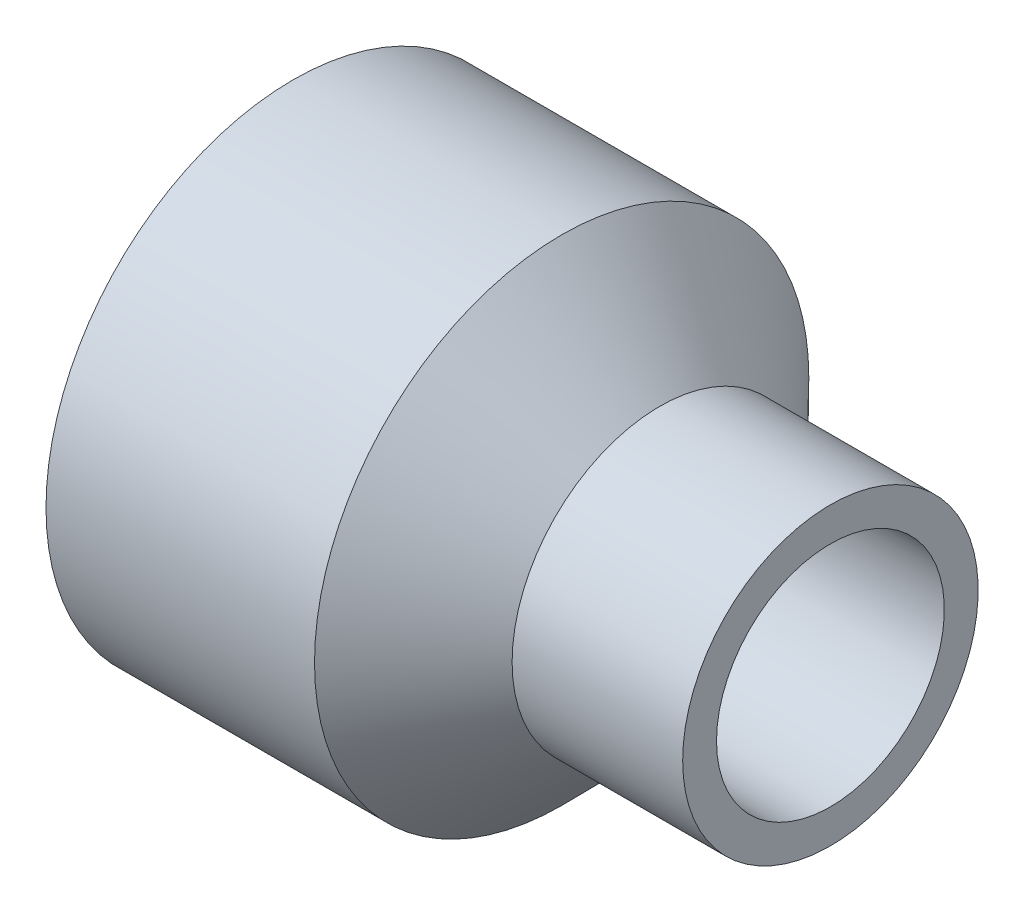
ISO-10303-21;
HEADER;
FILE_DESCRIPTION(('STEP AP214'),'2;1');
FILE_NAME('part.step','',(''),(''),'','','');
FILE_SCHEMA(('AUTOMOTIVE_DESIGN { 1 0 10303 214 1 1 1 1 }'));
ENDSEC;
DATA;
#1=APPLICATION_CONTEXT('core data for automotive mechanical design processes');
#2=APPLICATION_PROTOCOL_DEFINITION('international standard','automotive_design',2000,#1);
#3=PRODUCT_CONTEXT('',#1,'mechanical');
#4=PRODUCT('Part','Part','',(#3));
#5=PRODUCT_RELATED_PRODUCT_CATEGORY('part','',(#4));
#6=PRODUCT_DEFINITION_FORMATION('','',#4);
#7=PRODUCT_DEFINITION_CONTEXT('part definition',#1,'design');
#8=PRODUCT_DEFINITION('design','',#6,#7);
#9=PRODUCT_DEFINITION_SHAPE('','',#8);
#10=(LENGTH_UNIT() NAMED_UNIT(*) SI_UNIT(.MILLI.,.METRE.));
#11=(NAMED_UNIT(*) PLANE_ANGLE_UNIT() SI_UNIT($,.RADIAN.));
#12=(NAMED_UNIT(*) SI_UNIT($,.STERADIAN.) SOLID_ANGLE_UNIT());
#13=UNCERTAINTY_MEASURE_WITH_UNIT(LENGTH_MEASURE(1.E-05),#10,'distance_accuracy_value','');
#14=(GEOMETRIC_REPRESENTATION_CONTEXT(3) GLOBAL_UNCERTAINTY_ASSIGNED_CONTEXT((#13)) GLOBAL_UNIT_ASSIGNED_CONTEXT((#10,
#11,#12)) REPRESENTATION_CONTEXT('',''));
#15=CARTESIAN_POINT('',(0.,0.,0.));
#16=DIRECTION('',(0.,0.,1.));
#17=DIRECTION('',(1.,0.,0.));
#18=AXIS2_PLACEMENT_3D('',#15,#16,#17);
#19=CARTESIAN_POINT('',(-39.6875,0.,0.));
#20=DIRECTION('',(-1.,0.,0.));
#21=DIRECTION('',(0.,0.,1.));
#22=AXIS2_PLACEMENT_3D('',#19,#20,#21);
#23=CYLINDRICAL_SURFACE('',#22,36.5125);
#24=CARTESIAN_POINT('',(-0.0176611791230172,0.,0.));
#25=DIRECTION('',(-1.,0.,0.));
#26=DIRECTION('',(0.,0.,1.));
#27=AXIS2_PLACEMENT_3D('',#24,#25,#26);
#28=CIRCLE('',#27,36.5125);
#29=CARTESIAN_POINT('',(-0.0176611791230172,0.,36.5125));
#30=VERTEX_POINT('',#29);
#31=EDGE_CURVE('E63',#30,#30,#28,.T.);
#32=ORIENTED_EDGE('',*,*,#31,.T.);
#33=EDGE_LOOP('',(#32));
#34=FACE_BOUND('',#33,.T.);
#35=CARTESIAN_POINT('',(-39.6875,0.,0.));
#36=DIRECTION('',(-1.,0.,0.));
#37=DIRECTION('',(0.,0.,1.));
#38=AXIS2_PLACEMENT_3D('',#35,#36,#37);
#39=CIRCLE('',#38,36.5125);
#40=CARTESIAN_POINT('',(-39.6875,0.,36.5125));
#41=VERTEX_POINT('',#40);
#42=EDGE_CURVE('E10',#41,#41,#39,.T.);
#43=ORIENTED_EDGE('',*,*,#42,.F.);
#44=EDGE_LOOP('',(#43));
#45=FACE_BOUND('',#44,.T.);
#46=ADVANCED_FACE('F32',(#34,#45),#23,.T.);
#47=CARTESIAN_POINT('',(-39.6875,-36.5125,0.));
#48=DIRECTION('',(-1.,0.,0.));
#49=DIRECTION('',(0.,0.,1.));
#50=AXIS2_PLACEMENT_3D('',#47,#48,#49);
#51=PLANE('',#50);
#52=ORIENTED_EDGE('',*,*,#42,.T.);
#53=EDGE_LOOP('',(#52));
#54=FACE_BOUND('',#53,.T.);
#55=CARTESIAN_POINT('',(-39.6875,0.,0.));
#56=DIRECTION('',(-1.,0.,0.));
#57=DIRECTION('',(0.,0.,1.));
#58=AXIS2_PLACEMENT_3D('',#55,#56,#57);
#59=CIRCLE('',#58,30.3149);
#60=CARTESIAN_POINT('',(-39.6875,0.,30.3149));
#61=VERTEX_POINT('',#60);
#62=EDGE_CURVE('E38',#61,#61,#59,.T.);
#63=ORIENTED_EDGE('',*,*,#62,.F.);
#64=EDGE_LOOP('',(#63));
#65=FACE_BOUND('',#64,.T.);
#66=ADVANCED_FACE('F81',(#54,#65),#51,.T.);
#67=CARTESIAN_POINT('',(-2.38124999999999,0.,0.));
#68=DIRECTION('',(-1.,0.,0.));
#69=DIRECTION('',(0.,0.,1.));
#70=AXIS2_PLACEMENT_3D('',#67,#68,#69);
#71=CONICAL_SURFACE('',#70,30.0863,0.00612758288197578);
#72=ORIENTED_EDGE('',*,*,#62,.T.);
#73=EDGE_LOOP('',(#72));
#74=FACE_BOUND('',#73,.T.);
#75=CARTESIAN_POINT('',(-2.38124999999999,0.,0.));
#76=DIRECTION('',(-1.,0.,0.));
#77=DIRECTION('',(0.,0.,1.));
#78=AXIS2_PLACEMENT_3D('',#75,#76,#77);
#79=CIRCLE('',#78,30.0863);
#80=CARTESIAN_POINT('',(-2.38124999999999,0.,30.0863));
#81=VERTEX_POINT('',#80);
#82=EDGE_CURVE('E42',#81,#81,#79,.T.);
#83=ORIENTED_EDGE('',*,*,#82,.F.);
#84=EDGE_LOOP('',(#83));
#85=FACE_BOUND('',#84,.T.);
#86=ADVANCED_FACE('F85',(#74,#85),#71,.F.);
#87=CARTESIAN_POINT('',(8.84330971912998,0.,0.));
#88=DIRECTION('',(-1.,0.,0.));
#89=DIRECTION('',(0.,0.,1.));
#90=AXIS2_PLACEMENT_3D('',#87,#88,#89);
#91=CONICAL_SURFACE('',#90,14.39545,0.949837821159975);
#92=ORIENTED_EDGE('',*,*,#82,.T.);
#93=EDGE_LOOP('',(#92));
#94=FACE_BOUND('',#93,.T.);
#95=CARTESIAN_POINT('',(8.84330971912998,0.,0.));
#96=DIRECTION('',(-1.,0.,0.));
#97=DIRECTION('',(0.,0.,1.));
#98=AXIS2_PLACEMENT_3D('',#95,#96,#97);
#99=CIRCLE('',#98,14.39545);
#100=CARTESIAN_POINT('',(8.84330971912998,0.,14.39545));
#101=VERTEX_POINT('',#100);
#102=EDGE_CURVE('E46',#101,#101,#99,.T.);
#103=ORIENTED_EDGE('',*,*,#102,.F.);
#104=EDGE_LOOP('',(#103));
#105=FACE_BOUND('',#104,.T.);
#106=ADVANCED_FACE('F89',(#94,#105),#91,.F.);
#107=CARTESIAN_POINT('',(11.1125,0.,0.));
#108=DIRECTION('',(1.,0.,0.));
#109=DIRECTION('',(0.,0.,-1.));
#110=AXIS2_PLACEMENT_3D('',#107,#108,#109);
#111=CONICAL_SURFACE('',#110,16.637,0.779270580515469);
#112=ORIENTED_EDGE('',*,*,#102,.T.);
#113=EDGE_LOOP('',(#112));
#114=FACE_BOUND('',#113,.T.);
#115=CARTESIAN_POINT('',(11.1125,0.,0.));
#116=DIRECTION('',(-1.,0.,0.));
#117=DIRECTION('',(0.,0.,1.));
#118=AXIS2_PLACEMENT_3D('',#115,#116,#117);
#119=CIRCLE('',#118,16.637);
#120=CARTESIAN_POINT('',(11.1125,0.,16.637));
#121=VERTEX_POINT('',#120);
#122=EDGE_CURVE('E51',#121,#121,#119,.T.);
#123=ORIENTED_EDGE('',*,*,#122,.F.);
#124=EDGE_LOOP('',(#123));
#125=FACE_BOUND('',#124,.T.);
#126=ADVANCED_FACE('F95',(#114,#125),#111,.F.);
#127=CARTESIAN_POINT('',(39.6875,0.,0.));
#128=DIRECTION('',(1.,0.,0.));
#129=DIRECTION('',(0.,0.,-1.));
#130=AXIS2_PLACEMENT_3D('',#127,#128,#129);
#131=CONICAL_SURFACE('',#130,16.8275,0.00666656790386821);
#132=ORIENTED_EDGE('',*,*,#122,.T.);
#133=EDGE_LOOP('',(#132));
#134=FACE_BOUND('',#133,.T.);
#135=CARTESIAN_POINT('',(39.6875,0.,0.));
#136=DIRECTION('',(-1.,0.,0.));
#137=DIRECTION('',(0.,0.,1.));
#138=AXIS2_PLACEMENT_3D('',#135,#136,#137);
#139=CIRCLE('',#138,16.8275);
#140=CARTESIAN_POINT('',(39.6875,0.,16.8275));
#141=VERTEX_POINT('',#140);
#142=EDGE_CURVE('E54',#141,#141,#139,.T.);
#143=ORIENTED_EDGE('',*,*,#142,.F.);
#144=EDGE_LOOP('',(#143));
#145=FACE_BOUND('',#144,.T.);
#146=ADVANCED_FACE('F99',(#134,#145),#131,.F.);
#147=CARTESIAN_POINT('',(39.6875,-16.8275,0.));
#148=DIRECTION('',(1.,0.,0.));
#149=DIRECTION('',(0.,0.,-1.));
#150=AXIS2_PLACEMENT_3D('',#147,#148,#149);
#151=PLANE('',#150);
#152=ORIENTED_EDGE('',*,*,#142,.T.);
#153=EDGE_LOOP('',(#152));
#154=FACE_BOUND('',#153,.T.);
#155=CARTESIAN_POINT('',(39.6875,0.,0.));
#156=DIRECTION('',(-1.,0.,0.));
#157=DIRECTION('',(0.,0.,1.));
#158=AXIS2_PLACEMENT_3D('',#155,#156,#157);
#159=CIRCLE('',#158,21.828125);
#160=CARTESIAN_POINT('',(39.6875,0.,21.828125));
#161=VERTEX_POINT('',#160);
#162=EDGE_CURVE('E57',#161,#161,#159,.T.);
#163=ORIENTED_EDGE('',*,*,#162,.F.);
#164=EDGE_LOOP('',(#163));
#165=FACE_BOUND('',#164,.T.);
#166=ADVANCED_FACE('F77',(#154,#165),#151,.T.);
#167=CARTESIAN_POINT('',(-39.6875,0.,0.));
#168=DIRECTION('',(-1.,0.,0.));
#169=DIRECTION('',(0.,0.,1.));
#170=AXIS2_PLACEMENT_3D('',#167,#168,#169);
#171=CYLINDRICAL_SURFACE('',#170,21.828125);
#172=ORIENTED_EDGE('',*,*,#162,.T.);
#173=EDGE_LOOP('',(#172));
#174=FACE_BOUND('',#173,.T.);
#175=CARTESIAN_POINT('',(14.4878481467101,0.,0.));
#176=DIRECTION('',(-1.,0.,0.));
#177=DIRECTION('',(0.,0.,1.));
#178=AXIS2_PLACEMENT_3D('',#175,#176,#177);
#179=CIRCLE('',#178,21.828125);
#180=CARTESIAN_POINT('',(14.4878481467101,0.,21.828125));
#181=VERTEX_POINT('',#180);
#182=EDGE_CURVE('E60',#181,#181,#179,.T.);
#183=ORIENTED_EDGE('',*,*,#182,.F.);
#184=EDGE_LOOP('',(#183));
#185=FACE_BOUND('',#184,.T.);
#186=ADVANCED_FACE('F71',(#174,#185),#171,.T.);
#187=CARTESIAN_POINT('',(-0.0176611791230172,0.,0.));
#188=DIRECTION('',(-1.,0.,0.));
#189=DIRECTION('',(0.,0.,1.));
#190=AXIS2_PLACEMENT_3D('',#187,#188,#189);
#191=CONICAL_SURFACE('',#190,36.5125,0.791525746279426);
#192=ORIENTED_EDGE('',*,*,#182,.T.);
#193=EDGE_LOOP('',(#192));
#194=FACE_BOUND('',#193,.T.);
#195=ORIENTED_EDGE('',*,*,#31,.F.);
#196=EDGE_LOOP('',(#195));
#197=FACE_BOUND('',#196,.T.);
#198=ADVANCED_FACE('F69',(#194,#197),#191,.T.);
#199=CLOSED_SHELL('',(#46,#66,#86,#106,#126,#146,#166,#186,#198));
#200=MANIFOLD_SOLID_BREP('B2',#199);
#201=ADVANCED_BREP_SHAPE_REPRESENTATION('',(#18,#200),#14);
#202=SHAPE_DEFINITION_REPRESENTATION(#9,#201);
ENDSEC;
END-ISO-10303-21;
